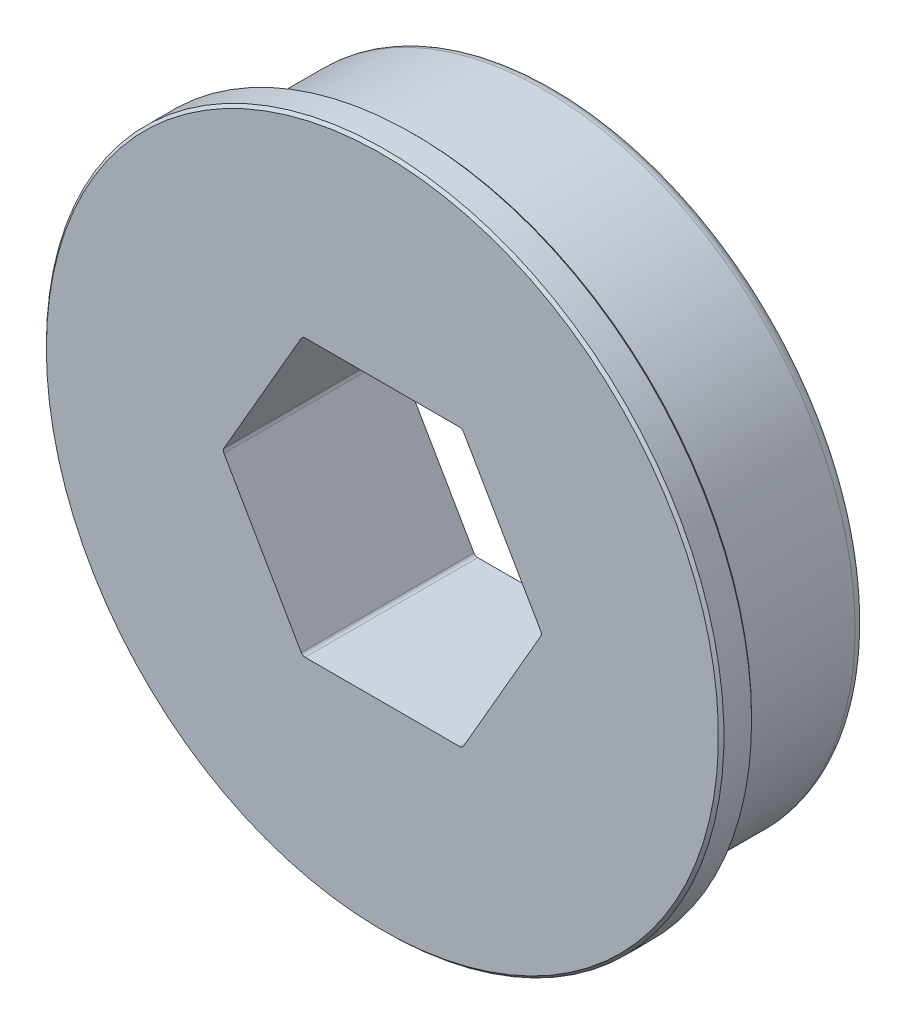
ISO-10303-21;
HEADER;
FILE_DESCRIPTION(('STEP AP214'),'2;1');
FILE_NAME('part.step','',(''),(''),'','','');
FILE_SCHEMA(('AUTOMOTIVE_DESIGN { 1 0 10303 214 1 1 1 1 }'));
ENDSEC;
DATA;
#1=APPLICATION_CONTEXT('core data for automotive mechanical design processes');
#2=APPLICATION_PROTOCOL_DEFINITION('international standard','automotive_design',2000,#1);
#3=PRODUCT_CONTEXT('',#1,'mechanical');
#4=PRODUCT('Part','Part','',(#3));
#5=PRODUCT_RELATED_PRODUCT_CATEGORY('part','',(#4));
#6=PRODUCT_DEFINITION_FORMATION('','',#4);
#7=PRODUCT_DEFINITION_CONTEXT('part definition',#1,'design');
#8=PRODUCT_DEFINITION('design','',#6,#7);
#9=PRODUCT_DEFINITION_SHAPE('','',#8);
#10=(LENGTH_UNIT() NAMED_UNIT(*) SI_UNIT(.MILLI.,.METRE.));
#11=(NAMED_UNIT(*) PLANE_ANGLE_UNIT() SI_UNIT($,.RADIAN.));
#12=(NAMED_UNIT(*) SI_UNIT($,.STERADIAN.) SOLID_ANGLE_UNIT());
#13=UNCERTAINTY_MEASURE_WITH_UNIT(LENGTH_MEASURE(1.E-05),#10,'distance_accuracy_value','');
#14=(GEOMETRIC_REPRESENTATION_CONTEXT(3) GLOBAL_UNCERTAINTY_ASSIGNED_CONTEXT((#13)) GLOBAL_UNIT_ASSIGNED_CONTEXT((#10,
#11,#12)) REPRESENTATION_CONTEXT('',''));
#15=CARTESIAN_POINT('',(0.,0.,0.));
#16=DIRECTION('',(0.,0.,1.));
#17=DIRECTION('',(1.,0.,0.));
#18=AXIS2_PLACEMENT_3D('',#15,#16,#17);
#19=CARTESIAN_POINT('',(0.,0.,7.92734));
#20=DIRECTION('',(0.,0.,-1.));
#21=DIRECTION('',(-1.,0.,0.));
#22=AXIS2_PLACEMENT_3D('',#19,#20,#21);
#23=CYLINDRICAL_SURFACE('',#22,13.97);
#24=CARTESIAN_POINT('',(0.,0.,6.40333999999999));
#25=DIRECTION('',(0.,0.,-1.));
#26=DIRECTION('',(-1.,0.,0.));
#27=AXIS2_PLACEMENT_3D('',#24,#25,#26);
#28=CIRCLE('',#27,13.97);
#29=CARTESIAN_POINT('',(-13.97,0.,6.40333999999999));
#30=VERTEX_POINT('',#29);
#31=EDGE_CURVE('E252',#30,#30,#28,.F.);
#32=ORIENTED_EDGE('',*,*,#31,.F.);
#33=EDGE_LOOP('',(#32));
#34=FACE_BOUND('',#33,.T.);
#35=CARTESIAN_POINT('',(0.,0.,5.89534));
#36=DIRECTION('',(0.,0.,-1.));
#37=DIRECTION('',(-1.,0.,0.));
#38=AXIS2_PLACEMENT_3D('',#35,#36,#37);
#39=CIRCLE('',#38,13.97);
#40=CARTESIAN_POINT('',(-13.97,0.,5.89534));
#41=VERTEX_POINT('',#40);
#42=EDGE_CURVE('E255',#41,#41,#39,.T.);
#43=ORIENTED_EDGE('',*,*,#42,.F.);
#44=EDGE_LOOP('',(#43));
#45=FACE_BOUND('',#44,.T.);
#46=ADVANCED_FACE('F14',(#34,#45),#23,.T.);
#47=CARTESIAN_POINT('',(14.2875,0.,5.89534));
#48=DIRECTION('',(0.,0.,1.));
#49=DIRECTION('',(1.,0.,0.));
#50=AXIS2_PLACEMENT_3D('',#47,#48,#49);
#51=PLANE('',#50);
#52=CARTESIAN_POINT('',(0.,0.,5.89534));
#53=DIRECTION('',(0.,0.,-1.));
#54=DIRECTION('',(-1.,0.,0.));
#55=AXIS2_PLACEMENT_3D('',#52,#53,#54);
#56=CIRCLE('',#55,14.2875);
#57=CARTESIAN_POINT('',(-14.2875,0.,5.89534));
#58=VERTEX_POINT('',#57);
#59=EDGE_CURVE('E249',#58,#58,#56,.T.);
#60=ORIENTED_EDGE('',*,*,#59,.F.);
#61=EDGE_LOOP('',(#60));
#62=FACE_BOUND('',#61,.T.);
#63=ORIENTED_EDGE('',*,*,#42,.T.);
#64=EDGE_LOOP('',(#63));
#65=FACE_BOUND('',#64,.T.);
#66=ADVANCED_FACE('F372',(#62,#65),#51,.T.);
#67=CARTESIAN_POINT('',(13.97,0.,6.40334));
#68=DIRECTION('',(0.,0.,-1.));
#69=DIRECTION('',(-1.,0.,0.));
#70=AXIS2_PLACEMENT_3D('',#67,#68,#69);
#71=PLANE('',#70);
#72=ORIENTED_EDGE('',*,*,#31,.T.);
#73=EDGE_LOOP('',(#72));
#74=FACE_BOUND('',#73,.T.);
#75=CARTESIAN_POINT('',(0.,0.,6.40334));
#76=DIRECTION('',(0.,0.,1.));
#77=DIRECTION('',(1.,0.,0.));
#78=AXIS2_PLACEMENT_3D('',#75,#76,#77);
#79=CIRCLE('',#78,15.4305);
#80=CARTESIAN_POINT('',(15.4305,0.,6.40334));
#81=VERTEX_POINT('',#80);
#82=EDGE_CURVE('E220',#81,#81,#79,.T.);
#83=ORIENTED_EDGE('',*,*,#82,.F.);
#84=EDGE_LOOP('',(#83));
#85=FACE_BOUND('',#84,.T.);
#86=ADVANCED_FACE('F370',(#74,#85),#71,.T.);
#87=CARTESIAN_POINT('',(0.,0.,7.92734));
#88=DIRECTION('',(0.,0.,-1.));
#89=DIRECTION('',(-1.,0.,0.));
#90=AXIS2_PLACEMENT_3D('',#87,#88,#89);
#91=CYLINDRICAL_SURFACE('',#90,14.2875);
#92=ORIENTED_EDGE('',*,*,#59,.T.);
#93=EDGE_LOOP('',(#92));
#94=FACE_BOUND('',#93,.T.);
#95=CARTESIAN_POINT('',(0.,0.,0.508));
#96=DIRECTION('',(0.,0.,-1.));
#97=DIRECTION('',(-1.,0.,0.));
#98=AXIS2_PLACEMENT_3D('',#95,#96,#97);
#99=CIRCLE('',#98,14.2875);
#100=CARTESIAN_POINT('',(-14.2875,0.,0.508));
#101=VERTEX_POINT('',#100);
#102=EDGE_CURVE('E217',#101,#101,#99,.T.);
#103=ORIENTED_EDGE('',*,*,#102,.F.);
#104=EDGE_LOOP('',(#103));
#105=FACE_BOUND('',#104,.T.);
#106=ADVANCED_FACE('F367',(#94,#105),#91,.T.);
#107=CARTESIAN_POINT('',(0.,0.,6.53034000000001));
#108=DIRECTION('',(0.,0.,1.));
#109=DIRECTION('',(1.,0.,0.));
#110=AXIS2_PLACEMENT_3D('',#107,#108,#109);
#111=CONICAL_SURFACE('',#110,15.5575,0.785398163397465);
#112=CARTESIAN_POINT('',(0.,0.,6.53034000000001));
#113=DIRECTION('',(0.,0.,-1.));
#114=DIRECTION('',(-1.,0.,0.));
#115=AXIS2_PLACEMENT_3D('',#112,#113,#114);
#116=CIRCLE('',#115,15.5575);
#117=CARTESIAN_POINT('',(-15.5575,0.,6.53034000000001));
#118=VERTEX_POINT('',#117);
#119=EDGE_CURVE('E81',#118,#118,#116,.F.);
#120=ORIENTED_EDGE('',*,*,#119,.F.);
#121=EDGE_LOOP('',(#120));
#122=FACE_BOUND('',#121,.T.);
#123=ORIENTED_EDGE('',*,*,#82,.T.);
#124=EDGE_LOOP('',(#123));
#125=FACE_BOUND('',#124,.T.);
#126=ADVANCED_FACE('F202',(#122,#125),#111,.T.);
#127=CARTESIAN_POINT('',(0.,0.,0.508));
#128=DIRECTION('',(0.,0.,-1.));
#129=DIRECTION('',(-1.,0.,0.));
#130=AXIS2_PLACEMENT_3D('',#127,#128,#129);
#131=TOROIDAL_SURFACE('',#130,13.7795,0.508);
#132=ORIENTED_EDGE('',*,*,#102,.T.);
#133=EDGE_LOOP('',(#132));
#134=FACE_BOUND('',#133,.T.);
#135=CARTESIAN_POINT('',(0.,0.,0.));
#136=DIRECTION('',(0.,0.,1.));
#137=DIRECTION('',(-1.,0.,0.));
#138=AXIS2_PLACEMENT_3D('',#135,#136,#137);
#139=CIRCLE('',#138,13.7795);
#140=CARTESIAN_POINT('',(13.7795,0.,0.));
#141=VERTEX_POINT('',#140);
#142=CARTESIAN_POINT('',(-13.7795,0.,0.));
#143=VERTEX_POINT('',#142);
#144=EDGE_CURVE('E240',#141,#143,#139,.F.);
#145=ORIENTED_EDGE('',*,*,#144,.F.);
#146=CARTESIAN_POINT('',(0.,0.,0.));
#147=DIRECTION('',(0.,0.,1.));
#148=DIRECTION('',(1.,0.,0.));
#149=AXIS2_PLACEMENT_3D('',#146,#147,#148);
#150=CIRCLE('',#149,13.7795);
#151=EDGE_CURVE('E150',#143,#141,#150,.F.);
#152=ORIENTED_EDGE('',*,*,#151,.F.);
#153=EDGE_LOOP('',(#145,#152));
#154=FACE_BOUND('',#153,.T.);
#155=ADVANCED_FACE('F196',(#134,#154),#131,.T.);
#156=CARTESIAN_POINT('',(0.,0.,7.92734));
#157=DIRECTION('',(0.,0.,-1.));
#158=DIRECTION('',(-1.,0.,0.));
#159=AXIS2_PLACEMENT_3D('',#156,#157,#158);
#160=CYLINDRICAL_SURFACE('',#159,15.5575);
#161=ORIENTED_EDGE('',*,*,#119,.T.);
#162=EDGE_LOOP('',(#161));
#163=FACE_BOUND('',#162,.T.);
#164=CARTESIAN_POINT('',(0.,0.,7.80034));
#165=DIRECTION('',(0.,0.,-1.));
#166=DIRECTION('',(-1.,0.,0.));
#167=AXIS2_PLACEMENT_3D('',#164,#165,#166);
#168=CIRCLE('',#167,15.5575);
#169=CARTESIAN_POINT('',(-15.5575,0.,7.80034));
#170=VERTEX_POINT('',#169);
#171=EDGE_CURVE('E141',#170,#170,#168,.F.);
#172=ORIENTED_EDGE('',*,*,#171,.F.);
#173=EDGE_LOOP('',(#172));
#174=FACE_BOUND('',#173,.T.);
#175=ADVANCED_FACE('F201',(#163,#174),#160,.T.);
#176=CARTESIAN_POINT('',(-7.09771326930958,0.,7.92734));
#177=DIRECTION('',(0.,0.,1.));
#178=DIRECTION('',(1.,0.,0.));
#179=AXIS2_PLACEMENT_3D('',#176,#177,#178);
#180=CYLINDRICAL_SURFACE('',#179,0.2032);
#181=DIRECTION('',(0.,0.,1.));
#182=VECTOR('',#181,1.);
#183=CARTESIAN_POINT('',(-7.27368963135858,-0.101600000000005,7.92734));
#184=LINE('',#183,#182);
#185=CARTESIAN_POINT('',(-7.27368963135857,-0.101600000000006,7.92734));
#186=VERTEX_POINT('',#185);
#187=CARTESIAN_POINT('',(-7.27368963135857,-0.101600000000005,0.));
#188=VERTEX_POINT('',#187);
#189=EDGE_CURVE('E139',#186,#188,#184,.F.);
#190=ORIENTED_EDGE('',*,*,#189,.T.);
#191=CARTESIAN_POINT('',(-7.09771326930958,0.,0.));
#192=DIRECTION('',(0.,0.,1.));
#193=DIRECTION('',(1.,0.,0.));
#194=AXIS2_PLACEMENT_3D('',#191,#192,#193);
#195=CIRCLE('',#194,0.2032);
#196=CARTESIAN_POINT('',(-7.27368963135857,0.101599999999994,0.));
#197=VERTEX_POINT('',#196);
#198=EDGE_CURVE('E89',#197,#188,#195,.T.);
#199=ORIENTED_EDGE('',*,*,#198,.F.);
#200=DIRECTION('',(0.,0.,1.));
#201=VECTOR('',#200,1.);
#202=CARTESIAN_POINT('',(-7.27368963135857,0.101599999999993,7.92734));
#203=LINE('',#202,#201);
#204=CARTESIAN_POINT('',(-7.27368963135857,0.101599999999994,7.92734));
#205=VERTEX_POINT('',#204);
#206=EDGE_CURVE('E85',#197,#205,#203,.T.);
#207=ORIENTED_EDGE('',*,*,#206,.T.);
#208=CARTESIAN_POINT('',(-7.09771326930958,0.,7.92734));
#209=DIRECTION('',(0.,0.,1.));
#210=DIRECTION('',(1.,0.,0.));
#211=AXIS2_PLACEMENT_3D('',#208,#209,#210);
#212=CIRCLE('',#211,0.2032);
#213=EDGE_CURVE('E69',#186,#205,#212,.F.);
#214=ORIENTED_EDGE('',*,*,#213,.F.);
#215=EDGE_LOOP('',(#190,#199,#207,#214));
#216=FACE_BOUND('',#215,.T.);
#217=ADVANCED_FACE('F86',(#216),#180,.F.);
#218=CARTESIAN_POINT('',(-3.54885663465479,6.14679999999999,7.92734));
#219=DIRECTION('',(0.,0.,1.));
#220=DIRECTION('',(1.,0.,0.));
#221=AXIS2_PLACEMENT_3D('',#218,#219,#220);
#222=CYLINDRICAL_SURFACE('',#221,0.2032);
#223=DIRECTION('',(0.,0.,1.));
#224=VECTOR('',#223,1.);
#225=CARTESIAN_POINT('',(-3.72483299670379,6.24839999999999,7.92734));
#226=LINE('',#225,#224);
#227=CARTESIAN_POINT('',(-3.72483299670379,6.24839999999999,7.92734));
#228=VERTEX_POINT('',#227);
#229=CARTESIAN_POINT('',(-3.72483299670378,6.24839999999999,0.));
#230=VERTEX_POINT('',#229);
#231=EDGE_CURVE('E99',#228,#230,#226,.F.);
#232=ORIENTED_EDGE('',*,*,#231,.T.);
#233=CARTESIAN_POINT('',(-3.54885663465479,6.14679999999999,0.));
#234=DIRECTION('',(0.,0.,1.));
#235=DIRECTION('',(1.,0.,0.));
#236=AXIS2_PLACEMENT_3D('',#233,#234,#235);
#237=CIRCLE('',#236,0.2032);
#238=CARTESIAN_POINT('',(-3.54885663465479,6.34999999999999,0.));
#239=VERTEX_POINT('',#238);
#240=EDGE_CURVE('E227',#239,#230,#237,.T.);
#241=ORIENTED_EDGE('',*,*,#240,.F.);
#242=DIRECTION('',(0.,0.,1.));
#243=VECTOR('',#242,1.);
#244=CARTESIAN_POINT('',(-3.54885663465479,6.34999999999999,7.92734));
#245=LINE('',#244,#243);
#246=CARTESIAN_POINT('',(-3.54885663465479,6.34999999999999,7.92734));
#247=VERTEX_POINT('',#246);
#248=EDGE_CURVE('E93',#239,#247,#245,.T.);
#249=ORIENTED_EDGE('',*,*,#248,.T.);
#250=CARTESIAN_POINT('',(-3.54885663465479,6.14679999999999,7.92734));
#251=DIRECTION('',(0.,0.,1.));
#252=DIRECTION('',(1.,0.,0.));
#253=AXIS2_PLACEMENT_3D('',#250,#251,#252);
#254=CIRCLE('',#253,0.2032);
#255=EDGE_CURVE('E80',#228,#247,#254,.F.);
#256=ORIENTED_EDGE('',*,*,#255,.F.);
#257=EDGE_LOOP('',(#232,#241,#249,#256));
#258=FACE_BOUND('',#257,.T.);
#259=ADVANCED_FACE('F317',(#258),#222,.F.);
#260=CARTESIAN_POINT('',(3.5488566346548,6.1468,7.92734));
#261=DIRECTION('',(0.,0.,1.));
#262=DIRECTION('',(1.,0.,0.));
#263=AXIS2_PLACEMENT_3D('',#260,#261,#262);
#264=CYLINDRICAL_SURFACE('',#263,0.2032);
#265=DIRECTION('',(0.,0.,1.));
#266=VECTOR('',#265,1.);
#267=CARTESIAN_POINT('',(3.5488566346548,6.35,7.92734));
#268=LINE('',#267,#266);
#269=CARTESIAN_POINT('',(3.5488566346548,6.34999999999999,7.92734));
#270=VERTEX_POINT('',#269);
#271=CARTESIAN_POINT('',(3.5488566346548,6.35,0.));
#272=VERTEX_POINT('',#271);
#273=EDGE_CURVE('E132',#270,#272,#268,.F.);
#274=ORIENTED_EDGE('',*,*,#273,.T.);
#275=CARTESIAN_POINT('',(3.5488566346548,6.1468,0.));
#276=DIRECTION('',(0.,0.,1.));
#277=DIRECTION('',(1.,0.,0.));
#278=AXIS2_PLACEMENT_3D('',#275,#276,#277);
#279=CIRCLE('',#278,0.2032);
#280=CARTESIAN_POINT('',(3.7248329967038,6.2484,0.));
#281=VERTEX_POINT('',#280);
#282=EDGE_CURVE('E230',#281,#272,#279,.T.);
#283=ORIENTED_EDGE('',*,*,#282,.F.);
#284=DIRECTION('',(0.,0.,1.));
#285=VECTOR('',#284,1.);
#286=CARTESIAN_POINT('',(3.72483299670379,6.2484,7.92734));
#287=LINE('',#286,#285);
#288=CARTESIAN_POINT('',(3.72483299670379,6.2484,7.92734));
#289=VERTEX_POINT('',#288);
#290=EDGE_CURVE('E122',#281,#289,#287,.T.);
#291=ORIENTED_EDGE('',*,*,#290,.T.);
#292=CARTESIAN_POINT('',(3.5488566346548,6.1468,7.92734));
#293=DIRECTION('',(0.,0.,1.));
#294=DIRECTION('',(1.,0.,0.));
#295=AXIS2_PLACEMENT_3D('',#292,#293,#294);
#296=CIRCLE('',#295,0.2032);
#297=EDGE_CURVE('E244',#270,#289,#296,.F.);
#298=ORIENTED_EDGE('',*,*,#297,.F.);
#299=EDGE_LOOP('',(#274,#283,#291,#298));
#300=FACE_BOUND('',#299,.T.);
#301=ADVANCED_FACE('F323',(#300),#264,.F.);
#302=CARTESIAN_POINT('',(7.09771326930959,0.,7.92734));
#303=DIRECTION('',(0.,0.,1.));
#304=DIRECTION('',(1.,0.,0.));
#305=AXIS2_PLACEMENT_3D('',#302,#303,#304);
#306=CYLINDRICAL_SURFACE('',#305,0.2032);
#307=CARTESIAN_POINT('',(7.09771326930959,0.,0.));
#308=DIRECTION('',(0.,0.,1.));
#309=DIRECTION('',(1.,0.,0.));
#310=AXIS2_PLACEMENT_3D('',#307,#308,#309);
#311=CIRCLE('',#310,0.2032);
#312=CARTESIAN_POINT('',(7.27368963135859,-0.101600000000005,0.));
#313=VERTEX_POINT('',#312);
#314=CARTESIAN_POINT('',(7.27368963135859,0.101599999999995,0.));
#315=VERTEX_POINT('',#314);
#316=EDGE_CURVE('E233',#313,#315,#311,.T.);
#317=ORIENTED_EDGE('',*,*,#316,.F.);
#318=DIRECTION('',(0.,0.,1.));
#319=VECTOR('',#318,1.);
#320=CARTESIAN_POINT('',(7.27368963135859,-0.101600000000005,7.92734));
#321=LINE('',#320,#319);
#322=CARTESIAN_POINT('',(7.27368963135859,-0.101600000000005,7.92734));
#323=VERTEX_POINT('',#322);
#324=EDGE_CURVE('E115',#313,#323,#321,.T.);
#325=ORIENTED_EDGE('',*,*,#324,.T.);
#326=CARTESIAN_POINT('',(7.09771326930959,0.,7.92734));
#327=DIRECTION('',(0.,0.,1.));
#328=DIRECTION('',(1.,0.,0.));
#329=AXIS2_PLACEMENT_3D('',#326,#327,#328);
#330=CIRCLE('',#329,0.2032);
#331=CARTESIAN_POINT('',(7.27368963135859,0.101599999999995,7.92734));
#332=VERTEX_POINT('',#331);
#333=EDGE_CURVE('E242',#332,#323,#330,.F.);
#334=ORIENTED_EDGE('',*,*,#333,.F.);
#335=DIRECTION('',(0.,0.,1.));
#336=VECTOR('',#335,1.);
#337=CARTESIAN_POINT('',(7.27368963135859,0.101599999999995,7.92734));
#338=LINE('',#337,#336);
#339=EDGE_CURVE('E126',#332,#315,#338,.F.);
#340=ORIENTED_EDGE('',*,*,#339,.T.);
#341=EDGE_LOOP('',(#317,#325,#334,#340));
#342=FACE_BOUND('',#341,.T.);
#343=ADVANCED_FACE('F304',(#342),#306,.F.);
#344=CARTESIAN_POINT('',(-3.54885663465478,-6.14680000000001,7.92734));
#345=DIRECTION('',(0.,0.,1.));
#346=DIRECTION('',(1.,0.,0.));
#347=AXIS2_PLACEMENT_3D('',#344,#345,#346);
#348=CYLINDRICAL_SURFACE('',#347,0.2032);
#349=DIRECTION('',(0.,0.,-1.));
#350=VECTOR('',#349,1.);
#351=CARTESIAN_POINT('',(-3.54885663465478,-6.35000000000001,7.92734));
#352=LINE('',#351,#350);
#353=CARTESIAN_POINT('',(-3.54885663465478,-6.35000000000001,7.92734));
#354=VERTEX_POINT('',#353);
#355=CARTESIAN_POINT('',(-3.54885663465478,-6.35000000000001,0.));
#356=VERTEX_POINT('',#355);
#357=EDGE_CURVE('E113',#354,#356,#352,.T.);
#358=ORIENTED_EDGE('',*,*,#357,.T.);
#359=CARTESIAN_POINT('',(-3.54885663465478,-6.14680000000001,0.));
#360=DIRECTION('',(0.,0.,1.));
#361=DIRECTION('',(1.,0.,0.));
#362=AXIS2_PLACEMENT_3D('',#359,#360,#361);
#363=CIRCLE('',#362,0.2032);
#364=CARTESIAN_POINT('',(-3.72483299670378,-6.24840000000001,0.));
#365=VERTEX_POINT('',#364);
#366=EDGE_CURVE('E236',#365,#356,#363,.T.);
#367=ORIENTED_EDGE('',*,*,#366,.F.);
#368=DIRECTION('',(0.,0.,1.));
#369=VECTOR('',#368,1.);
#370=CARTESIAN_POINT('',(-3.72483299670378,-6.24840000000001,7.92734));
#371=LINE('',#370,#369);
#372=CARTESIAN_POINT('',(-3.72483299670378,-6.24840000000001,7.92734));
#373=VERTEX_POINT('',#372);
#374=EDGE_CURVE('E136',#365,#373,#371,.T.);
#375=ORIENTED_EDGE('',*,*,#374,.T.);
#376=CARTESIAN_POINT('',(-3.54885663465478,-6.14680000000001,7.92734));
#377=DIRECTION('',(0.,0.,1.));
#378=DIRECTION('',(1.,0.,0.));
#379=AXIS2_PLACEMENT_3D('',#376,#377,#378);
#380=CIRCLE('',#379,0.2032);
#381=EDGE_CURVE('E34',#354,#373,#380,.F.);
#382=ORIENTED_EDGE('',*,*,#381,.F.);
#383=EDGE_LOOP('',(#358,#367,#375,#382));
#384=FACE_BOUND('',#383,.T.);
#385=ADVANCED_FACE('F167',(#384),#348,.F.);
#386=CARTESIAN_POINT('',(0.,0.,0.));
#387=DIRECTION('',(0.,0.,-1.));
#388=DIRECTION('',(-1.,0.,0.));
#389=AXIS2_PLACEMENT_3D('',#386,#387,#388);
#390=PLANE('',#389);
#391=DIRECTION('',(-1.,0.,0.));
#392=VECTOR('',#391,1.);
#393=CARTESIAN_POINT('',(-3.66617420935412,6.34999999999999,0.));
#394=LINE('',#393,#392);
#395=EDGE_CURVE('E129',#272,#239,#394,.T.);
#396=ORIENTED_EDGE('',*,*,#395,.T.);
#397=ORIENTED_EDGE('',*,*,#240,.T.);
#398=DIRECTION('',(-0.5,-0.866025403784439,0.));
#399=VECTOR('',#398,1.);
#400=CARTESIAN_POINT('',(-7.33234841870824,0.,0.));
#401=LINE('',#400,#399);
#402=EDGE_CURVE('E94',#230,#197,#401,.T.);
#403=ORIENTED_EDGE('',*,*,#402,.T.);
#404=ORIENTED_EDGE('',*,*,#198,.T.);
#405=DIRECTION('',(0.5,-0.866025403784439,0.));
#406=VECTOR('',#405,1.);
#407=CARTESIAN_POINT('',(-3.66617420935411,-6.35000000000001,0.));
#408=LINE('',#407,#406);
#409=EDGE_CURVE('E138',#188,#365,#408,.T.);
#410=ORIENTED_EDGE('',*,*,#409,.T.);
#411=ORIENTED_EDGE('',*,*,#366,.T.);
#412=DIRECTION('',(1.,0.,0.));
#413=VECTOR('',#412,1.);
#414=CARTESIAN_POINT('',(3.66617420935413,-6.35000000000001,0.));
#415=LINE('',#414,#413);
#416=CARTESIAN_POINT('',(3.5488566346548,-6.35000000000001,0.));
#417=VERTEX_POINT('',#416);
#418=EDGE_CURVE('E112',#356,#417,#415,.T.);
#419=ORIENTED_EDGE('',*,*,#418,.T.);
#420=CARTESIAN_POINT('',(3.5488566346548,-6.14680000000001,0.));
#421=DIRECTION('',(0.,0.,1.));
#422=DIRECTION('',(1.,0.,0.));
#423=AXIS2_PLACEMENT_3D('',#420,#421,#422);
#424=CIRCLE('',#423,0.2032);
#425=CARTESIAN_POINT('',(3.7248329967038,-6.24840000000001,0.));
#426=VERTEX_POINT('',#425);
#427=EDGE_CURVE('E224',#417,#426,#424,.T.);
#428=ORIENTED_EDGE('',*,*,#427,.T.);
#429=DIRECTION('',(0.5,0.866025403784439,0.));
#430=VECTOR('',#429,1.);
#431=CARTESIAN_POINT('',(7.33234841870825,0.,0.));
#432=LINE('',#431,#430);
#433=EDGE_CURVE('E118',#426,#313,#432,.T.);
#434=ORIENTED_EDGE('',*,*,#433,.T.);
#435=ORIENTED_EDGE('',*,*,#316,.T.);
#436=DIRECTION('',(-0.5,0.866025403784439,0.));
#437=VECTOR('',#436,1.);
#438=CARTESIAN_POINT('',(3.66617420935413,6.35,0.));
#439=LINE('',#438,#437);
#440=EDGE_CURVE('E125',#315,#281,#439,.T.);
#441=ORIENTED_EDGE('',*,*,#440,.T.);
#442=ORIENTED_EDGE('',*,*,#282,.T.);
#443=EDGE_LOOP('',(#396,#397,#403,#404,#410,#411,#419,#428,#434,#435,#441,#442));
#444=FACE_BOUND('',#443,.T.);
#445=ORIENTED_EDGE('',*,*,#151,.T.);
#446=ORIENTED_EDGE('',*,*,#144,.T.);
#447=EDGE_LOOP('',(#445,#446));
#448=FACE_BOUND('',#447,.T.);
#449=ADVANCED_FACE('F156',(#444,#448),#390,.T.);
#450=CARTESIAN_POINT('',(3.5488566346548,-6.14680000000001,7.92734));
#451=DIRECTION('',(0.,0.,1.));
#452=DIRECTION('',(1.,0.,0.));
#453=AXIS2_PLACEMENT_3D('',#450,#451,#452);
#454=CYLINDRICAL_SURFACE('',#453,0.2032);
#455=DIRECTION('',(0.,0.,1.));
#456=VECTOR('',#455,1.);
#457=CARTESIAN_POINT('',(3.7248329967038,-6.2484,7.92734));
#458=LINE('',#457,#456);
#459=CARTESIAN_POINT('',(3.7248329967038,-6.2484,7.92734));
#460=VERTEX_POINT('',#459);
#461=EDGE_CURVE('E119',#460,#426,#458,.F.);
#462=ORIENTED_EDGE('',*,*,#461,.T.);
#463=ORIENTED_EDGE('',*,*,#427,.F.);
#464=DIRECTION('',(0.,0.,-1.));
#465=VECTOR('',#464,1.);
#466=CARTESIAN_POINT('',(3.5488566346548,-6.35000000000001,7.92734));
#467=LINE('',#466,#465);
#468=CARTESIAN_POINT('',(3.5488566346548,-6.35000000000001,7.92734));
#469=VERTEX_POINT('',#468);
#470=EDGE_CURVE('E109',#417,#469,#467,.F.);
#471=ORIENTED_EDGE('',*,*,#470,.T.);
#472=CARTESIAN_POINT('',(3.5488566346548,-6.14680000000001,7.92734));
#473=DIRECTION('',(0.,0.,1.));
#474=DIRECTION('',(1.,0.,0.));
#475=AXIS2_PLACEMENT_3D('',#472,#473,#474);
#476=CIRCLE('',#475,0.2032);
#477=EDGE_CURVE('E191',#460,#469,#476,.F.);
#478=ORIENTED_EDGE('',*,*,#477,.F.);
#479=EDGE_LOOP('',(#462,#463,#471,#478));
#480=FACE_BOUND('',#479,.T.);
#481=ADVANCED_FACE('F166',(#480),#454,.F.);
#482=CARTESIAN_POINT('',(0.,0.,7.80034));
#483=DIRECTION('',(0.,0.,-1.));
#484=DIRECTION('',(-1.,0.,0.));
#485=AXIS2_PLACEMENT_3D('',#482,#483,#484);
#486=CONICAL_SURFACE('',#485,15.5575,0.785398163397442);
#487=ORIENTED_EDGE('',*,*,#171,.T.);
#488=EDGE_LOOP('',(#487));
#489=FACE_BOUND('',#488,.T.);
#490=CARTESIAN_POINT('',(0.,0.,7.92734));
#491=DIRECTION('',(0.,0.,-1.));
#492=DIRECTION('',(-1.,0.,0.));
#493=AXIS2_PLACEMENT_3D('',#490,#491,#492);
#494=CIRCLE('',#493,15.4305);
#495=CARTESIAN_POINT('',(-15.4305,0.,7.92734));
#496=VERTEX_POINT('',#495);
#497=EDGE_CURVE('E105',#496,#496,#494,.F.);
#498=ORIENTED_EDGE('',*,*,#497,.F.);
#499=EDGE_LOOP('',(#498));
#500=FACE_BOUND('',#499,.T.);
#501=ADVANCED_FACE('F348',(#489,#500),#486,.T.);
#502=CARTESIAN_POINT('',(-3.66617420935411,-6.35000000000001,7.92734));
#503=DIRECTION('',(-0.866025403784439,-0.5,0.));
#504=DIRECTION('',(0.5,-0.866025403784439,0.));
#505=AXIS2_PLACEMENT_3D('',#502,#503,#504);
#506=PLANE('',#505);
#507=ORIENTED_EDGE('',*,*,#374,.F.);
#508=ORIENTED_EDGE('',*,*,#409,.F.);
#509=ORIENTED_EDGE('',*,*,#189,.F.);
#510=DIRECTION('',(-0.5,0.866025403784438,0.));
#511=VECTOR('',#510,1.);
#512=CARTESIAN_POINT('',(-3.72483299670378,-6.24840000000001,7.92734));
#513=LINE('',#512,#511);
#514=EDGE_CURVE('E79',#373,#186,#513,.T.);
#515=ORIENTED_EDGE('',*,*,#514,.F.);
#516=EDGE_LOOP('',(#507,#508,#509,#515));
#517=FACE_BOUND('',#516,.T.);
#518=ADVANCED_FACE('F313',(#517),#506,.F.);
#519=CARTESIAN_POINT('',(-7.33234841870824,0.,7.92734));
#520=DIRECTION('',(-0.866025403784439,0.5,0.));
#521=DIRECTION('',(-0.5,-0.866025403784439,0.));
#522=AXIS2_PLACEMENT_3D('',#519,#520,#521);
#523=PLANE('',#522);
#524=ORIENTED_EDGE('',*,*,#206,.F.);
#525=ORIENTED_EDGE('',*,*,#402,.F.);
#526=ORIENTED_EDGE('',*,*,#231,.F.);
#527=DIRECTION('',(0.5,0.866025403784439,0.));
#528=VECTOR('',#527,1.);
#529=CARTESIAN_POINT('',(-7.27368963135857,0.101599999999993,7.92734));
#530=LINE('',#529,#528);
#531=EDGE_CURVE('E77',#205,#228,#530,.T.);
#532=ORIENTED_EDGE('',*,*,#531,.F.);
#533=EDGE_LOOP('',(#524,#525,#526,#532));
#534=FACE_BOUND('',#533,.T.);
#535=ADVANCED_FACE('F97',(#534),#523,.F.);
#536=CARTESIAN_POINT('',(-3.66617420935412,6.34999999999999,7.92734));
#537=DIRECTION('',(0.,1.,0.));
#538=DIRECTION('',(-1.,0.,0.));
#539=AXIS2_PLACEMENT_3D('',#536,#537,#538);
#540=PLANE('',#539);
#541=ORIENTED_EDGE('',*,*,#273,.F.);
#542=DIRECTION('',(1.,0.,0.));
#543=VECTOR('',#542,1.);
#544=CARTESIAN_POINT('',(15.5575,6.34999999999999,7.92734));
#545=LINE('',#544,#543);
#546=EDGE_CURVE('E100',#247,#270,#545,.T.);
#547=ORIENTED_EDGE('',*,*,#546,.F.);
#548=ORIENTED_EDGE('',*,*,#248,.F.);
#549=ORIENTED_EDGE('',*,*,#395,.F.);
#550=EDGE_LOOP('',(#541,#547,#548,#549));
#551=FACE_BOUND('',#550,.T.);
#552=ADVANCED_FACE('F321',(#551),#540,.F.);
#553=CARTESIAN_POINT('',(3.66617420935413,6.35,7.92734));
#554=DIRECTION('',(0.866025403784439,0.5,0.));
#555=DIRECTION('',(-0.5,0.866025403784439,0.));
#556=AXIS2_PLACEMENT_3D('',#553,#554,#555);
#557=PLANE('',#556);
#558=ORIENTED_EDGE('',*,*,#290,.F.);
#559=ORIENTED_EDGE('',*,*,#440,.F.);
#560=ORIENTED_EDGE('',*,*,#339,.F.);
#561=DIRECTION('',(0.5,-0.866025403784438,0.));
#562=VECTOR('',#561,1.);
#563=CARTESIAN_POINT('',(3.72483299670379,6.2484,7.92734));
#564=LINE('',#563,#562);
#565=EDGE_CURVE('E103',#289,#332,#564,.T.);
#566=ORIENTED_EDGE('',*,*,#565,.F.);
#567=EDGE_LOOP('',(#558,#559,#560,#566));
#568=FACE_BOUND('',#567,.T.);
#569=ADVANCED_FACE('F310',(#568),#557,.F.);
#570=CARTESIAN_POINT('',(7.33234841870825,0.,7.92734));
#571=DIRECTION('',(0.866025403784439,-0.5,0.));
#572=DIRECTION('',(0.5,0.866025403784439,0.));
#573=AXIS2_PLACEMENT_3D('',#570,#571,#572);
#574=PLANE('',#573);
#575=ORIENTED_EDGE('',*,*,#324,.F.);
#576=ORIENTED_EDGE('',*,*,#433,.F.);
#577=ORIENTED_EDGE('',*,*,#461,.F.);
#578=DIRECTION('',(-0.5,-0.866025403784439,0.));
#579=VECTOR('',#578,1.);
#580=CARTESIAN_POINT('',(7.27368963135859,-0.101600000000005,7.92734));
#581=LINE('',#580,#579);
#582=EDGE_CURVE('E25',#323,#460,#581,.T.);
#583=ORIENTED_EDGE('',*,*,#582,.F.);
#584=EDGE_LOOP('',(#575,#576,#577,#583));
#585=FACE_BOUND('',#584,.T.);
#586=ADVANCED_FACE('F301',(#585),#574,.F.);
#587=CARTESIAN_POINT('',(3.66617420935413,-6.35000000000001,7.92734));
#588=DIRECTION('',(0.,-1.,0.));
#589=DIRECTION('',(0.,0.,-1.));
#590=AXIS2_PLACEMENT_3D('',#587,#588,#589);
#591=PLANE('',#590);
#592=ORIENTED_EDGE('',*,*,#470,.F.);
#593=ORIENTED_EDGE('',*,*,#418,.F.);
#594=ORIENTED_EDGE('',*,*,#357,.F.);
#595=DIRECTION('',(1.,0.,0.));
#596=VECTOR('',#595,1.);
#597=CARTESIAN_POINT('',(15.5575,-6.35000000000001,7.92734));
#598=LINE('',#597,#596);
#599=EDGE_CURVE('E9',#469,#354,#598,.F.);
#600=ORIENTED_EDGE('',*,*,#599,.F.);
#601=EDGE_LOOP('',(#592,#593,#594,#600));
#602=FACE_BOUND('',#601,.T.);
#603=ADVANCED_FACE('F293',(#602),#591,.F.);
#604=CARTESIAN_POINT('',(15.5575,0.,7.92734));
#605=DIRECTION('',(0.,0.,1.));
#606=DIRECTION('',(1.,0.,0.));
#607=AXIS2_PLACEMENT_3D('',#604,#605,#606);
#608=PLANE('',#607);
#609=ORIENTED_EDGE('',*,*,#599,.T.);
#610=ORIENTED_EDGE('',*,*,#381,.T.);
#611=ORIENTED_EDGE('',*,*,#514,.T.);
#612=ORIENTED_EDGE('',*,*,#213,.T.);
#613=ORIENTED_EDGE('',*,*,#531,.T.);
#614=ORIENTED_EDGE('',*,*,#255,.T.);
#615=ORIENTED_EDGE('',*,*,#546,.T.);
#616=ORIENTED_EDGE('',*,*,#297,.T.);
#617=ORIENTED_EDGE('',*,*,#565,.T.);
#618=ORIENTED_EDGE('',*,*,#333,.T.);
#619=ORIENTED_EDGE('',*,*,#582,.T.);
#620=ORIENTED_EDGE('',*,*,#477,.T.);
#621=EDGE_LOOP('',(#609,#610,#611,#612,#613,#614,#615,#616,#617,#618,#619,#620));
#622=FACE_BOUND('',#621,.T.);
#623=ORIENTED_EDGE('',*,*,#497,.T.);
#624=EDGE_LOOP('',(#623));
#625=FACE_BOUND('',#624,.T.);
#626=ADVANCED_FACE('F74',(#622,#625),#608,.T.);
#627=CLOSED_SHELL('',(#46,#66,#86,#106,#126,#155,#175,#217,#259,#301,#343,#385,#449,#481,#501,
#518,#535,#552,#569,#586,#603,#626));
#628=MANIFOLD_SOLID_BREP('B1',#627);
#629=ADVANCED_BREP_SHAPE_REPRESENTATION('',(#18,#628),#14);
#630=SHAPE_DEFINITION_REPRESENTATION(#9,#629);
ENDSEC;
END-ISO-10303-21;
